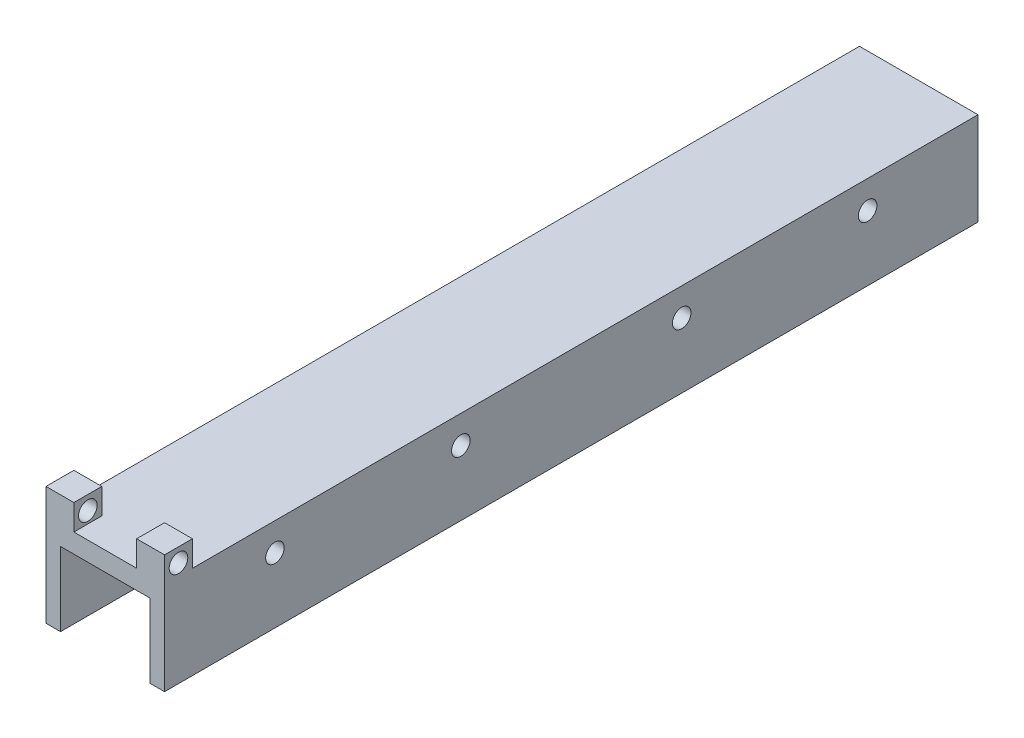
ISO-10303-21;
HEADER;
FILE_DESCRIPTION(('STEP AP214'),'2;1');
FILE_NAME('part.step','',(''),(''),'','','');
FILE_SCHEMA(('AUTOMOTIVE_DESIGN { 1 0 10303 214 1 1 1 1 }'));
ENDSEC;
DATA;
#1=APPLICATION_CONTEXT('core data for automotive mechanical design processes');
#2=APPLICATION_PROTOCOL_DEFINITION('international standard','automotive_design',2000,#1);
#3=PRODUCT_CONTEXT('',#1,'mechanical');
#4=PRODUCT('Part','Part','',(#3));
#5=PRODUCT_RELATED_PRODUCT_CATEGORY('part','',(#4));
#6=PRODUCT_DEFINITION_FORMATION('','',#4);
#7=PRODUCT_DEFINITION_CONTEXT('part definition',#1,'design');
#8=PRODUCT_DEFINITION('design','',#6,#7);
#9=PRODUCT_DEFINITION_SHAPE('','',#8);
#10=(LENGTH_UNIT() NAMED_UNIT(*) SI_UNIT(.MILLI.,.METRE.));
#11=(NAMED_UNIT(*) PLANE_ANGLE_UNIT() SI_UNIT($,.RADIAN.));
#12=(NAMED_UNIT(*) SI_UNIT($,.STERADIAN.) SOLID_ANGLE_UNIT());
#13=UNCERTAINTY_MEASURE_WITH_UNIT(LENGTH_MEASURE(1.E-05),#10,'distance_accuracy_value','');
#14=(GEOMETRIC_REPRESENTATION_CONTEXT(3) GLOBAL_UNCERTAINTY_ASSIGNED_CONTEXT((#13)) GLOBAL_UNIT_ASSIGNED_CONTEXT((#10,
#11,#12)) REPRESENTATION_CONTEXT('',''));
#15=CARTESIAN_POINT('',(0.,0.,0.));
#16=DIRECTION('',(0.,0.,1.));
#17=DIRECTION('',(1.,0.,0.));
#18=AXIS2_PLACEMENT_3D('',#15,#16,#17);
#19=CARTESIAN_POINT('',(3.175,16.129,-177.8));
#20=DIRECTION('',(0.,-1.,0.));
#21=DIRECTION('',(0.,0.,-1.));
#22=AXIS2_PLACEMENT_3D('',#19,#20,#21);
#23=PLANE('',#22);
#24=DIRECTION('',(0.,0.,1.));
#25=VECTOR('',#24,1.);
#26=CARTESIAN_POINT('',(3.175,16.129,-177.8));
#27=LINE('',#26,#25);
#28=CARTESIAN_POINT('',(3.175,16.129,-23.4228939259205));
#29=VERTEX_POINT('',#28);
#30=CARTESIAN_POINT('',(3.175,16.129,0.));
#31=VERTEX_POINT('',#30);
#32=EDGE_CURVE('E430',#29,#31,#27,.T.);
#33=ORIENTED_EDGE('',*,*,#32,.F.);
#34=DIRECTION('',(-1.,0.,0.));
#35=VECTOR('',#34,1.);
#36=CARTESIAN_POINT('',(25.908,16.129,-23.4228939259205));
#37=LINE('',#36,#35);
#38=CARTESIAN_POINT('',(22.733,16.129,-23.4228939259205));
#39=VERTEX_POINT('',#38);
#40=EDGE_CURVE('E335',#29,#39,#37,.F.);
#41=ORIENTED_EDGE('',*,*,#40,.T.);
#42=DIRECTION('',(0.,0.,1.));
#43=VECTOR('',#42,1.);
#44=CARTESIAN_POINT('',(22.733,16.129,-177.8));
#45=LINE('',#44,#43);
#46=CARTESIAN_POINT('',(22.733,16.129,0.));
#47=VERTEX_POINT('',#46);
#48=EDGE_CURVE('E424',#39,#47,#45,.T.);
#49=ORIENTED_EDGE('',*,*,#48,.T.);
#50=DIRECTION('',(1.,0.,0.));
#51=VECTOR('',#50,1.);
#52=CARTESIAN_POINT('',(3.175,16.129,0.));
#53=LINE('',#52,#51);
#54=EDGE_CURVE('E383',#31,#47,#53,.T.);
#55=ORIENTED_EDGE('',*,*,#54,.F.);
#56=EDGE_LOOP('',(#33,#41,#49,#55));
#57=FACE_BOUND('',#56,.T.);
#58=ADVANCED_FACE('F47',(#57),#23,.T.);
#59=CARTESIAN_POINT('',(22.733,16.129,-64.0628939259205));
#60=VERTEX_POINT('',#59);
#61=CARTESIAN_POINT('',(22.733,16.129,-24.8371060740794));
#62=VERTEX_POINT('',#61);
#63=EDGE_CURVE('E489',#60,#62,#45,.T.);
#64=ORIENTED_EDGE('',*,*,#63,.T.);
#65=DIRECTION('',(-1.,0.,0.));
#66=VECTOR('',#65,1.);
#67=CARTESIAN_POINT('',(25.908,16.129,-24.8371060740794));
#68=LINE('',#67,#66);
#69=CARTESIAN_POINT('',(3.175,16.129,-24.8371060740794));
#70=VERTEX_POINT('',#69);
#71=EDGE_CURVE('E331',#62,#70,#68,.T.);
#72=ORIENTED_EDGE('',*,*,#71,.T.);
#73=CARTESIAN_POINT('',(3.175,16.129,-64.0628939259205));
#74=VERTEX_POINT('',#73);
#75=EDGE_CURVE('E447',#74,#70,#27,.T.);
#76=ORIENTED_EDGE('',*,*,#75,.F.);
#77=DIRECTION('',(-1.,0.,0.));
#78=VECTOR('',#77,1.);
#79=CARTESIAN_POINT('',(25.908,16.129,-64.0628939259205));
#80=LINE('',#79,#78);
#81=EDGE_CURVE('E323',#74,#60,#80,.F.);
#82=ORIENTED_EDGE('',*,*,#81,.T.);
#83=EDGE_LOOP('',(#64,#72,#76,#82));
#84=FACE_BOUND('',#83,.T.);
#85=ADVANCED_FACE('F453',(#84),#23,.T.);
#86=CARTESIAN_POINT('',(22.733,16.129,-112.32289392592));
#87=VERTEX_POINT('',#86);
#88=CARTESIAN_POINT('',(22.733,16.129,-65.4771060740795));
#89=VERTEX_POINT('',#88);
#90=EDGE_CURVE('E491',#87,#89,#45,.T.);
#91=ORIENTED_EDGE('',*,*,#90,.T.);
#92=DIRECTION('',(-1.,0.,0.));
#93=VECTOR('',#92,1.);
#94=CARTESIAN_POINT('',(25.908,16.129,-65.4771060740795));
#95=LINE('',#94,#93);
#96=CARTESIAN_POINT('',(3.175,16.129,-65.4771060740795));
#97=VERTEX_POINT('',#96);
#98=EDGE_CURVE('E319',#89,#97,#95,.T.);
#99=ORIENTED_EDGE('',*,*,#98,.T.);
#100=CARTESIAN_POINT('',(3.175,16.129,-112.32289392592));
#101=VERTEX_POINT('',#100);
#102=EDGE_CURVE('E449',#101,#97,#27,.T.);
#103=ORIENTED_EDGE('',*,*,#102,.F.);
#104=DIRECTION('',(-1.,0.,0.));
#105=VECTOR('',#104,1.);
#106=CARTESIAN_POINT('',(25.908,16.129,-112.32289392592));
#107=LINE('',#106,#105);
#108=EDGE_CURVE('E311',#101,#87,#107,.F.);
#109=ORIENTED_EDGE('',*,*,#108,.T.);
#110=EDGE_LOOP('',(#91,#99,#103,#109));
#111=FACE_BOUND('',#110,.T.);
#112=ADVANCED_FACE('F501',(#111),#23,.T.);
#113=CARTESIAN_POINT('',(22.733,16.129,-152.96289392592));
#114=VERTEX_POINT('',#113);
#115=CARTESIAN_POINT('',(22.733,16.129,-113.737106074079));
#116=VERTEX_POINT('',#115);
#117=EDGE_CURVE('E423',#114,#116,#45,.T.);
#118=ORIENTED_EDGE('',*,*,#117,.T.);
#119=DIRECTION('',(-1.,0.,0.));
#120=VECTOR('',#119,1.);
#121=CARTESIAN_POINT('',(25.908,16.129,-113.737106074079));
#122=LINE('',#121,#120);
#123=CARTESIAN_POINT('',(3.175,16.129,-113.737106074079));
#124=VERTEX_POINT('',#123);
#125=EDGE_CURVE('E307',#116,#124,#122,.T.);
#126=ORIENTED_EDGE('',*,*,#125,.T.);
#127=CARTESIAN_POINT('',(3.175,16.129,-152.96289392592));
#128=VERTEX_POINT('',#127);
#129=EDGE_CURVE('E429',#128,#124,#27,.T.);
#130=ORIENTED_EDGE('',*,*,#129,.F.);
#131=DIRECTION('',(-1.,0.,0.));
#132=VECTOR('',#131,1.);
#133=CARTESIAN_POINT('',(25.908,16.129,-152.96289392592));
#134=LINE('',#133,#132);
#135=EDGE_CURVE('E299',#128,#114,#134,.F.);
#136=ORIENTED_EDGE('',*,*,#135,.T.);
#137=EDGE_LOOP('',(#118,#126,#130,#136));
#138=FACE_BOUND('',#137,.T.);
#139=ADVANCED_FACE('F484',(#138),#23,.T.);
#140=CARTESIAN_POINT('',(22.733,16.129,-177.8));
#141=VERTEX_POINT('',#140);
#142=CARTESIAN_POINT('',(22.733,16.129,-154.377106074079));
#143=VERTEX_POINT('',#142);
#144=EDGE_CURVE('E419',#141,#143,#45,.T.);
#145=ORIENTED_EDGE('',*,*,#144,.T.);
#146=DIRECTION('',(-1.,0.,0.));
#147=VECTOR('',#146,1.);
#148=CARTESIAN_POINT('',(25.908,16.129,-154.377106074079));
#149=LINE('',#148,#147);
#150=CARTESIAN_POINT('',(3.175,16.129,-154.377106074079));
#151=VERTEX_POINT('',#150);
#152=EDGE_CURVE('E272',#143,#151,#149,.T.);
#153=ORIENTED_EDGE('',*,*,#152,.T.);
#154=CARTESIAN_POINT('',(3.175,16.129,-177.8));
#155=VERTEX_POINT('',#154);
#156=EDGE_CURVE('E425',#155,#151,#27,.T.);
#157=ORIENTED_EDGE('',*,*,#156,.F.);
#158=DIRECTION('',(1.,0.,0.));
#159=VECTOR('',#158,1.);
#160=CARTESIAN_POINT('',(3.175,16.129,-177.8));
#161=LINE('',#160,#159);
#162=EDGE_CURVE('E353',#155,#141,#161,.T.);
#163=ORIENTED_EDGE('',*,*,#162,.T.);
#164=EDGE_LOOP('',(#145,#153,#157,#163));
#165=FACE_BOUND('',#164,.T.);
#166=ADVANCED_FACE('F478',(#165),#23,.T.);
#167=CARTESIAN_POINT('',(0.,0.,-177.8));
#168=DIRECTION('',(0.,-1.,0.));
#169=DIRECTION('',(0.,0.,-1.));
#170=AXIS2_PLACEMENT_3D('',#167,#168,#169);
#171=PLANE('',#170);
#172=DIRECTION('',(1.,0.,0.));
#173=VECTOR('',#172,1.);
#174=CARTESIAN_POINT('',(0.,0.,0.));
#175=LINE('',#174,#173);
#176=CARTESIAN_POINT('',(0.,0.,0.));
#177=VERTEX_POINT('',#176);
#178=CARTESIAN_POINT('',(3.175,0.,0.));
#179=VERTEX_POINT('',#178);
#180=EDGE_CURVE('E343',#177,#179,#175,.T.);
#181=ORIENTED_EDGE('',*,*,#180,.F.);
#182=DIRECTION('',(0.,0.,1.));
#183=VECTOR('',#182,1.);
#184=CARTESIAN_POINT('',(0.,0.,-177.8));
#185=LINE('',#184,#183);
#186=CARTESIAN_POINT('',(0.,0.,-177.8));
#187=VERTEX_POINT('',#186);
#188=EDGE_CURVE('E405',#187,#177,#185,.T.);
#189=ORIENTED_EDGE('',*,*,#188,.F.);
#190=DIRECTION('',(1.,0.,0.));
#191=VECTOR('',#190,1.);
#192=CARTESIAN_POINT('',(0.,0.,-177.8));
#193=LINE('',#192,#191);
#194=CARTESIAN_POINT('',(3.175,0.,-177.8));
#195=VERTEX_POINT('',#194);
#196=EDGE_CURVE('E344',#187,#195,#193,.T.);
#197=ORIENTED_EDGE('',*,*,#196,.T.);
#198=DIRECTION('',(0.,0.,1.));
#199=VECTOR('',#198,1.);
#200=CARTESIAN_POINT('',(3.175,0.,-177.8));
#201=LINE('',#200,#199);
#202=EDGE_CURVE('E375',#195,#179,#201,.T.);
#203=ORIENTED_EDGE('',*,*,#202,.T.);
#204=EDGE_LOOP('',(#181,#189,#197,#203));
#205=FACE_BOUND('',#204,.T.);
#206=ADVANCED_FACE('F49',(#205),#171,.T.);
#207=CARTESIAN_POINT('',(0.,0.,-177.8));
#208=DIRECTION('',(-1.,0.,0.));
#209=DIRECTION('',(0.,0.,1.));
#210=AXIS2_PLACEMENT_3D('',#207,#208,#209);
#211=PLANE('',#210);
#212=CARTESIAN_POINT('',(0.,22.86,-3.048));
#213=DIRECTION('',(-1.,0.,0.));
#214=DIRECTION('',(0.,0.,1.));
#215=AXIS2_PLACEMENT_3D('',#212,#213,#214);
#216=CIRCLE('',#215,2.032);
#217=CARTESIAN_POINT('',(0.,22.86,-1.016));
#218=VERTEX_POINT('',#217);
#219=EDGE_CURVE('E736',#218,#218,#216,.T.);
#220=ORIENTED_EDGE('',*,*,#219,.F.);
#221=EDGE_LOOP('',(#220));
#222=FACE_BOUND('',#221,.T.);
#223=CARTESIAN_POINT('',(0.,14.224,-24.13));
#224=DIRECTION('',(1.,0.,0.));
#225=DIRECTION('',(0.,0.,-1.));
#226=AXIS2_PLACEMENT_3D('',#223,#224,#225);
#227=CIRCLE('',#226,2.032);
#228=CARTESIAN_POINT('',(0.,14.224,-26.162));
#229=VERTEX_POINT('',#228);
#230=EDGE_CURVE('E273',#229,#229,#227,.T.);
#231=ORIENTED_EDGE('',*,*,#230,.T.);
#232=EDGE_LOOP('',(#231));
#233=FACE_BOUND('',#232,.T.);
#234=CARTESIAN_POINT('',(0.,14.224,-64.77));
#235=DIRECTION('',(1.,0.,0.));
#236=DIRECTION('',(0.,0.,-1.));
#237=AXIS2_PLACEMENT_3D('',#234,#235,#236);
#238=CIRCLE('',#237,2.03200000000001);
#239=CARTESIAN_POINT('',(0.,14.224,-66.802));
#240=VERTEX_POINT('',#239);
#241=EDGE_CURVE('E277',#240,#240,#238,.T.);
#242=ORIENTED_EDGE('',*,*,#241,.T.);
#243=EDGE_LOOP('',(#242));
#244=FACE_BOUND('',#243,.T.);
#245=CARTESIAN_POINT('',(0.,14.224,-113.03));
#246=DIRECTION('',(1.,0.,0.));
#247=DIRECTION('',(0.,0.,1.));
#248=AXIS2_PLACEMENT_3D('',#245,#246,#247);
#249=CIRCLE('',#248,2.03200000000001);
#250=CARTESIAN_POINT('',(0.,14.224,-110.998));
#251=VERTEX_POINT('',#250);
#252=EDGE_CURVE('E285',#251,#251,#249,.T.);
#253=ORIENTED_EDGE('',*,*,#252,.T.);
#254=EDGE_LOOP('',(#253));
#255=FACE_BOUND('',#254,.T.);
#256=CARTESIAN_POINT('',(0.,14.224,-153.67));
#257=DIRECTION('',(1.,0.,0.));
#258=DIRECTION('',(0.,0.,1.));
#259=AXIS2_PLACEMENT_3D('',#256,#257,#258);
#260=CIRCLE('',#259,2.03200000000001);
#261=CARTESIAN_POINT('',(0.,14.224,-151.638));
#262=VERTEX_POINT('',#261);
#263=EDGE_CURVE('E229',#262,#262,#260,.T.);
#264=ORIENTED_EDGE('',*,*,#263,.T.);
#265=EDGE_LOOP('',(#264));
#266=FACE_BOUND('',#265,.T.);
#267=DIRECTION('',(0.,-1.,0.));
#268=VECTOR('',#267,1.);
#269=CARTESIAN_POINT('',(0.,0.,0.));
#270=LINE('',#269,#268);
#271=CARTESIAN_POINT('',(0.,25.908,0.));
#272=VERTEX_POINT('',#271);
#273=EDGE_CURVE('E349',#272,#177,#270,.T.);
#274=ORIENTED_EDGE('',*,*,#273,.F.);
#275=DIRECTION('',(0.,0.,1.));
#276=VECTOR('',#275,1.);
#277=CARTESIAN_POINT('',(0.,25.908,0.));
#278=LINE('',#277,#276);
#279=CARTESIAN_POINT('',(0.,25.908,-6.096));
#280=VERTEX_POINT('',#279);
#281=EDGE_CURVE('E253',#280,#272,#278,.T.);
#282=ORIENTED_EDGE('',*,*,#281,.F.);
#283=DIRECTION('',(0.,-1.,0.));
#284=VECTOR('',#283,1.);
#285=CARTESIAN_POINT('',(0.,25.908,-6.096));
#286=LINE('',#285,#284);
#287=CARTESIAN_POINT('',(0.,20.32,-6.09599999999999));
#288=VERTEX_POINT('',#287);
#289=EDGE_CURVE('E244',#280,#288,#286,.T.);
#290=ORIENTED_EDGE('',*,*,#289,.T.);
#291=DIRECTION('',(0.,0.,1.));
#292=VECTOR('',#291,1.);
#293=CARTESIAN_POINT('',(0.,20.32,-177.8));
#294=LINE('',#293,#292);
#295=CARTESIAN_POINT('',(0.,20.32,-177.8));
#296=VERTEX_POINT('',#295);
#297=EDGE_CURVE('E64',#296,#288,#294,.T.);
#298=ORIENTED_EDGE('',*,*,#297,.F.);
#299=DIRECTION('',(0.,-1.,0.));
#300=VECTOR('',#299,1.);
#301=CARTESIAN_POINT('',(0.,0.,-177.8));
#302=LINE('',#301,#300);
#303=EDGE_CURVE('E371',#296,#187,#302,.T.);
#304=ORIENTED_EDGE('',*,*,#303,.T.);
#305=ORIENTED_EDGE('',*,*,#188,.T.);
#306=EDGE_LOOP('',(#274,#282,#290,#298,#304,#305));
#307=FACE_BOUND('',#306,.T.);
#308=ADVANCED_FACE('F514',(#222,#233,#244,#255,#266,#307),#211,.T.);
#309=CARTESIAN_POINT('',(0.,20.32,-177.8));
#310=DIRECTION('',(0.,1.,0.));
#311=DIRECTION('',(0.,0.,1.));
#312=AXIS2_PLACEMENT_3D('',#309,#310,#311);
#313=PLANE('',#312);
#314=DIRECTION('',(0.,0.,1.));
#315=VECTOR('',#314,1.);
#316=CARTESIAN_POINT('',(19.812,20.32,0.));
#317=LINE('',#316,#315);
#318=CARTESIAN_POINT('',(19.812,20.32,-6.096));
#319=VERTEX_POINT('',#318);
#320=CARTESIAN_POINT('',(19.812,20.32,0.));
#321=VERTEX_POINT('',#320);
#322=EDGE_CURVE('E218',#319,#321,#317,.T.);
#323=ORIENTED_EDGE('',*,*,#322,.F.);
#324=DIRECTION('',(-1.,0.,0.));
#325=VECTOR('',#324,1.);
#326=CARTESIAN_POINT('',(25.908,20.32,-6.096));
#327=LINE('',#326,#325);
#328=CARTESIAN_POINT('',(25.908,20.32,-6.09599999999999));
#329=VERTEX_POINT('',#328);
#330=EDGE_CURVE('E71',#329,#319,#327,.T.);
#331=ORIENTED_EDGE('',*,*,#330,.F.);
#332=DIRECTION('',(0.,0.,1.));
#333=VECTOR('',#332,1.);
#334=CARTESIAN_POINT('',(25.908,20.32,-177.8));
#335=LINE('',#334,#333);
#336=CARTESIAN_POINT('',(25.908,20.32,-177.8));
#337=VERTEX_POINT('',#336);
#338=EDGE_CURVE('E222',#337,#329,#335,.T.);
#339=ORIENTED_EDGE('',*,*,#338,.F.);
#340=DIRECTION('',(-1.,0.,0.));
#341=VECTOR('',#340,1.);
#342=CARTESIAN_POINT('',(0.,20.32,-177.8));
#343=LINE('',#342,#341);
#344=EDGE_CURVE('E368',#337,#296,#343,.T.);
#345=ORIENTED_EDGE('',*,*,#344,.T.);
#346=ORIENTED_EDGE('',*,*,#297,.T.);
#347=DIRECTION('',(-1.,0.,0.));
#348=VECTOR('',#347,1.);
#349=CARTESIAN_POINT('',(0.,20.32,-6.096));
#350=LINE('',#349,#348);
#351=CARTESIAN_POINT('',(6.096,20.32,-6.096));
#352=VERTEX_POINT('',#351);
#353=EDGE_CURVE('E249',#352,#288,#350,.T.);
#354=ORIENTED_EDGE('',*,*,#353,.F.);
#355=DIRECTION('',(0.,0.,-1.));
#356=VECTOR('',#355,1.);
#357=CARTESIAN_POINT('',(6.096,20.32,0.));
#358=LINE('',#357,#356);
#359=CARTESIAN_POINT('',(6.096,20.32,0.));
#360=VERTEX_POINT('',#359);
#361=EDGE_CURVE('E252',#360,#352,#358,.T.);
#362=ORIENTED_EDGE('',*,*,#361,.F.);
#363=DIRECTION('',(-1.,0.,0.));
#364=VECTOR('',#363,1.);
#365=CARTESIAN_POINT('',(0.,20.32,0.));
#366=LINE('',#365,#364);
#367=EDGE_CURVE('E398',#321,#360,#366,.T.);
#368=ORIENTED_EDGE('',*,*,#367,.F.);
#369=EDGE_LOOP('',(#323,#331,#339,#345,#346,#354,#362,#368));
#370=FACE_BOUND('',#369,.T.);
#371=ADVANCED_FACE('F517',(#370),#313,.T.);
#372=CARTESIAN_POINT('',(25.908,0.,-177.8));
#373=DIRECTION('',(1.,0.,0.));
#374=DIRECTION('',(0.,0.,-1.));
#375=AXIS2_PLACEMENT_3D('',#372,#373,#374);
#376=PLANE('',#375);
#377=CARTESIAN_POINT('',(25.908,22.86,-3.048));
#378=DIRECTION('',(-1.,0.,0.));
#379=DIRECTION('',(0.,0.,1.));
#380=AXIS2_PLACEMENT_3D('',#377,#378,#379);
#381=CIRCLE('',#380,2.032);
#382=CARTESIAN_POINT('',(25.908,22.86,-1.016));
#383=VERTEX_POINT('',#382);
#384=EDGE_CURVE('E742',#383,#383,#381,.T.);
#385=ORIENTED_EDGE('',*,*,#384,.T.);
#386=EDGE_LOOP('',(#385));
#387=FACE_BOUND('',#386,.T.);
#388=CARTESIAN_POINT('',(25.908,14.224,-24.13));
#389=DIRECTION('',(1.,0.,0.));
#390=DIRECTION('',(0.,0.,-1.));
#391=AXIS2_PLACEMENT_3D('',#388,#389,#390);
#392=CIRCLE('',#391,2.032);
#393=CARTESIAN_POINT('',(25.908,14.224,-26.162));
#394=VERTEX_POINT('',#393);
#395=EDGE_CURVE('E268',#394,#394,#392,.T.);
#396=ORIENTED_EDGE('',*,*,#395,.F.);
#397=EDGE_LOOP('',(#396));
#398=FACE_BOUND('',#397,.T.);
#399=CARTESIAN_POINT('',(25.908,14.224,-64.77));
#400=DIRECTION('',(1.,0.,0.));
#401=DIRECTION('',(0.,0.,-1.));
#402=AXIS2_PLACEMENT_3D('',#399,#400,#401);
#403=CIRCLE('',#402,2.03200000000001);
#404=CARTESIAN_POINT('',(25.908,14.224,-66.802));
#405=VERTEX_POINT('',#404);
#406=EDGE_CURVE('E281',#405,#405,#403,.T.);
#407=ORIENTED_EDGE('',*,*,#406,.F.);
#408=EDGE_LOOP('',(#407));
#409=FACE_BOUND('',#408,.T.);
#410=CARTESIAN_POINT('',(25.908,14.224,-113.03));
#411=DIRECTION('',(1.,0.,0.));
#412=DIRECTION('',(0.,0.,1.));
#413=AXIS2_PLACEMENT_3D('',#410,#411,#412);
#414=CIRCLE('',#413,2.03200000000001);
#415=CARTESIAN_POINT('',(25.908,14.224,-110.998));
#416=VERTEX_POINT('',#415);
#417=EDGE_CURVE('E289',#416,#416,#414,.T.);
#418=ORIENTED_EDGE('',*,*,#417,.F.);
#419=EDGE_LOOP('',(#418));
#420=FACE_BOUND('',#419,.T.);
#421=CARTESIAN_POINT('',(25.908,14.224,-153.67));
#422=DIRECTION('',(1.,0.,0.));
#423=DIRECTION('',(0.,0.,1.));
#424=AXIS2_PLACEMENT_3D('',#421,#422,#423);
#425=CIRCLE('',#424,2.03200000000001);
#426=CARTESIAN_POINT('',(25.908,14.224,-151.638));
#427=VERTEX_POINT('',#426);
#428=EDGE_CURVE('E224',#427,#427,#425,.T.);
#429=ORIENTED_EDGE('',*,*,#428,.F.);
#430=EDGE_LOOP('',(#429));
#431=FACE_BOUND('',#430,.T.);
#432=DIRECTION('',(0.,1.,0.));
#433=VECTOR('',#432,1.);
#434=CARTESIAN_POINT('',(25.908,0.,0.));
#435=LINE('',#434,#433);
#436=CARTESIAN_POINT('',(25.908,0.,0.));
#437=VERTEX_POINT('',#436);
#438=CARTESIAN_POINT('',(25.908,25.908,0.));
#439=VERTEX_POINT('',#438);
#440=EDGE_CURVE('E395',#437,#439,#435,.T.);
#441=ORIENTED_EDGE('',*,*,#440,.F.);
#442=DIRECTION('',(0.,0.,1.));
#443=VECTOR('',#442,1.);
#444=CARTESIAN_POINT('',(25.908,0.,-177.8));
#445=LINE('',#444,#443);
#446=CARTESIAN_POINT('',(25.908,0.,-177.8));
#447=VERTEX_POINT('',#446);
#448=EDGE_CURVE('E413',#447,#437,#445,.T.);
#449=ORIENTED_EDGE('',*,*,#448,.F.);
#450=DIRECTION('',(0.,1.,0.));
#451=VECTOR('',#450,1.);
#452=CARTESIAN_POINT('',(25.908,0.,-177.8));
#453=LINE('',#452,#451);
#454=EDGE_CURVE('E365',#447,#337,#453,.T.);
#455=ORIENTED_EDGE('',*,*,#454,.T.);
#456=ORIENTED_EDGE('',*,*,#338,.T.);
#457=DIRECTION('',(0.,-1.,0.));
#458=VECTOR('',#457,1.);
#459=CARTESIAN_POINT('',(25.908,25.908,-6.096));
#460=LINE('',#459,#458);
#461=CARTESIAN_POINT('',(25.908,25.908,-6.096));
#462=VERTEX_POINT('',#461);
#463=EDGE_CURVE('E201',#462,#329,#460,.T.);
#464=ORIENTED_EDGE('',*,*,#463,.F.);
#465=DIRECTION('',(0.,0.,-1.));
#466=VECTOR('',#465,1.);
#467=CARTESIAN_POINT('',(25.908,25.908,0.));
#468=LINE('',#467,#466);
#469=EDGE_CURVE('E208',#439,#462,#468,.T.);
#470=ORIENTED_EDGE('',*,*,#469,.F.);
#471=EDGE_LOOP('',(#441,#449,#455,#456,#464,#470));
#472=FACE_BOUND('',#471,.T.);
#473=ADVANCED_FACE('F220',(#387,#398,#409,#420,#431,#472),#376,.T.);
#474=CARTESIAN_POINT('',(22.733,0.,-177.8));
#475=DIRECTION('',(0.,-1.,0.));
#476=DIRECTION('',(0.,0.,-1.));
#477=AXIS2_PLACEMENT_3D('',#474,#475,#476);
#478=PLANE('',#477);
#479=DIRECTION('',(1.,0.,0.));
#480=VECTOR('',#479,1.);
#481=CARTESIAN_POINT('',(22.733,0.,0.));
#482=LINE('',#481,#480);
#483=CARTESIAN_POINT('',(22.733,0.,0.));
#484=VERTEX_POINT('',#483);
#485=EDGE_CURVE('E391',#484,#437,#482,.T.);
#486=ORIENTED_EDGE('',*,*,#485,.F.);
#487=DIRECTION('',(0.,0.,1.));
#488=VECTOR('',#487,1.);
#489=CARTESIAN_POINT('',(22.733,0.,-177.8));
#490=LINE('',#489,#488);
#491=CARTESIAN_POINT('',(22.733,0.,-177.8));
#492=VERTEX_POINT('',#491);
#493=EDGE_CURVE('E416',#492,#484,#490,.T.);
#494=ORIENTED_EDGE('',*,*,#493,.F.);
#495=DIRECTION('',(1.,0.,0.));
#496=VECTOR('',#495,1.);
#497=CARTESIAN_POINT('',(22.733,0.,-177.8));
#498=LINE('',#497,#496);
#499=EDGE_CURVE('E361',#492,#447,#498,.T.);
#500=ORIENTED_EDGE('',*,*,#499,.T.);
#501=ORIENTED_EDGE('',*,*,#448,.T.);
#502=EDGE_LOOP('',(#486,#494,#500,#501));
#503=FACE_BOUND('',#502,.T.);
#504=ADVANCED_FACE('F540',(#503),#478,.T.);
#505=CARTESIAN_POINT('',(22.733,16.129,-177.8));
#506=DIRECTION('',(-1.,0.,0.));
#507=DIRECTION('',(0.,0.,1.));
#508=AXIS2_PLACEMENT_3D('',#505,#506,#507);
#509=PLANE('',#508);
#510=ORIENTED_EDGE('',*,*,#48,.F.);
#511=CARTESIAN_POINT('',(22.733,14.224,-24.13));
#512=DIRECTION('',(-1.,0.,0.));
#513=DIRECTION('',(0.,0.,1.));
#514=AXIS2_PLACEMENT_3D('',#511,#512,#513);
#515=CIRCLE('',#514,2.032);
#516=EDGE_CURVE('E339',#39,#62,#515,.F.);
#517=ORIENTED_EDGE('',*,*,#516,.T.);
#518=ORIENTED_EDGE('',*,*,#63,.F.);
#519=CARTESIAN_POINT('',(22.733,14.224,-64.77));
#520=DIRECTION('',(-1.,0.,0.));
#521=DIRECTION('',(0.,0.,1.));
#522=AXIS2_PLACEMENT_3D('',#519,#520,#521);
#523=CIRCLE('',#522,2.03200000000001);
#524=EDGE_CURVE('E327',#60,#89,#523,.F.);
#525=ORIENTED_EDGE('',*,*,#524,.T.);
#526=ORIENTED_EDGE('',*,*,#90,.F.);
#527=CARTESIAN_POINT('',(22.733,14.224,-113.03));
#528=DIRECTION('',(-1.,0.,0.));
#529=DIRECTION('',(0.,0.,1.));
#530=AXIS2_PLACEMENT_3D('',#527,#528,#529);
#531=CIRCLE('',#530,2.03200000000001);
#532=EDGE_CURVE('E315',#87,#116,#531,.F.);
#533=ORIENTED_EDGE('',*,*,#532,.T.);
#534=ORIENTED_EDGE('',*,*,#117,.F.);
#535=CARTESIAN_POINT('',(22.733,14.224,-153.67));
#536=DIRECTION('',(-1.,0.,0.));
#537=DIRECTION('',(0.,0.,1.));
#538=AXIS2_PLACEMENT_3D('',#535,#536,#537);
#539=CIRCLE('',#538,2.03200000000001);
#540=EDGE_CURVE('E303',#114,#143,#539,.F.);
#541=ORIENTED_EDGE('',*,*,#540,.T.);
#542=ORIENTED_EDGE('',*,*,#144,.F.);
#543=DIRECTION('',(0.,-1.,0.));
#544=VECTOR('',#543,1.);
#545=CARTESIAN_POINT('',(22.733,16.129,-177.8));
#546=LINE('',#545,#544);
#547=EDGE_CURVE('E357',#141,#492,#546,.T.);
#548=ORIENTED_EDGE('',*,*,#547,.T.);
#549=ORIENTED_EDGE('',*,*,#493,.T.);
#550=DIRECTION('',(0.,-1.,0.));
#551=VECTOR('',#550,1.);
#552=CARTESIAN_POINT('',(22.733,16.129,0.));
#553=LINE('',#552,#551);
#554=EDGE_CURVE('E387',#47,#484,#553,.T.);
#555=ORIENTED_EDGE('',*,*,#554,.F.);
#556=EDGE_LOOP('',(#510,#517,#518,#525,#526,#533,#534,#541,#542,#548,#549,#555));
#557=FACE_BOUND('',#556,.T.);
#558=ADVANCED_FACE('F495',(#557),#509,.T.);
#559=CARTESIAN_POINT('',(3.175,0.,-177.8));
#560=DIRECTION('',(1.,0.,0.));
#561=DIRECTION('',(0.,0.,-1.));
#562=AXIS2_PLACEMENT_3D('',#559,#560,#561);
#563=PLANE('',#562);
#564=ORIENTED_EDGE('',*,*,#75,.T.);
#565=CARTESIAN_POINT('',(3.175,14.224,-24.13));
#566=DIRECTION('',(1.,0.,0.));
#567=DIRECTION('',(0.,0.,-1.));
#568=AXIS2_PLACEMENT_3D('',#565,#566,#567);
#569=CIRCLE('',#568,2.032);
#570=EDGE_CURVE('E11',#70,#29,#569,.F.);
#571=ORIENTED_EDGE('',*,*,#570,.T.);
#572=ORIENTED_EDGE('',*,*,#32,.T.);
#573=DIRECTION('',(0.,1.,0.));
#574=VECTOR('',#573,1.);
#575=CARTESIAN_POINT('',(3.175,0.,0.));
#576=LINE('',#575,#574);
#577=EDGE_CURVE('E379',#179,#31,#576,.T.);
#578=ORIENTED_EDGE('',*,*,#577,.F.);
#579=ORIENTED_EDGE('',*,*,#202,.F.);
#580=DIRECTION('',(0.,1.,0.));
#581=VECTOR('',#580,1.);
#582=CARTESIAN_POINT('',(3.175,0.,-177.8));
#583=LINE('',#582,#581);
#584=EDGE_CURVE('E348',#195,#155,#583,.T.);
#585=ORIENTED_EDGE('',*,*,#584,.T.);
#586=ORIENTED_EDGE('',*,*,#156,.T.);
#587=CARTESIAN_POINT('',(3.175,14.224,-153.67));
#588=DIRECTION('',(1.,0.,0.));
#589=DIRECTION('',(0.,0.,-1.));
#590=AXIS2_PLACEMENT_3D('',#587,#588,#589);
#591=CIRCLE('',#590,2.03200000000001);
#592=EDGE_CURVE('E408',#151,#128,#591,.F.);
#593=ORIENTED_EDGE('',*,*,#592,.T.);
#594=ORIENTED_EDGE('',*,*,#129,.T.);
#595=CARTESIAN_POINT('',(3.175,14.224,-113.03));
#596=DIRECTION('',(1.,0.,0.));
#597=DIRECTION('',(0.,0.,-1.));
#598=AXIS2_PLACEMENT_3D('',#595,#596,#597);
#599=CIRCLE('',#598,2.03200000000001);
#600=EDGE_CURVE('E436',#124,#101,#599,.F.);
#601=ORIENTED_EDGE('',*,*,#600,.T.);
#602=ORIENTED_EDGE('',*,*,#102,.T.);
#603=CARTESIAN_POINT('',(3.175,14.224,-64.77));
#604=DIRECTION('',(1.,0.,0.));
#605=DIRECTION('',(0.,0.,-1.));
#606=AXIS2_PLACEMENT_3D('',#603,#604,#605);
#607=CIRCLE('',#606,2.03200000000001);
#608=EDGE_CURVE('E57',#97,#74,#607,.F.);
#609=ORIENTED_EDGE('',*,*,#608,.T.);
#610=EDGE_LOOP('',(#564,#571,#572,#578,#579,#585,#586,#593,#594,#601,#602,#609));
#611=FACE_BOUND('',#610,.T.);
#612=ADVANCED_FACE('F446',(#611),#563,.T.);
#613=CARTESIAN_POINT('',(0.,0.,-177.8));
#614=DIRECTION('',(0.,0.,1.));
#615=DIRECTION('',(1.,0.,0.));
#616=AXIS2_PLACEMENT_3D('',#613,#614,#615);
#617=PLANE('',#616);
#618=ORIENTED_EDGE('',*,*,#196,.F.);
#619=ORIENTED_EDGE('',*,*,#303,.F.);
#620=ORIENTED_EDGE('',*,*,#344,.F.);
#621=ORIENTED_EDGE('',*,*,#454,.F.);
#622=ORIENTED_EDGE('',*,*,#499,.F.);
#623=ORIENTED_EDGE('',*,*,#547,.F.);
#624=ORIENTED_EDGE('',*,*,#162,.F.);
#625=ORIENTED_EDGE('',*,*,#584,.F.);
#626=EDGE_LOOP('',(#618,#619,#620,#621,#622,#623,#624,#625));
#627=FACE_BOUND('',#626,.T.);
#628=ADVANCED_FACE('F473',(#627),#617,.F.);
#629=CARTESIAN_POINT('',(0.,0.,0.));
#630=DIRECTION('',(0.,0.,1.));
#631=DIRECTION('',(1.,0.,0.));
#632=AXIS2_PLACEMENT_3D('',#629,#630,#631);
#633=PLANE('',#632);
#634=ORIENTED_EDGE('',*,*,#180,.T.);
#635=ORIENTED_EDGE('',*,*,#577,.T.);
#636=ORIENTED_EDGE('',*,*,#54,.T.);
#637=ORIENTED_EDGE('',*,*,#554,.T.);
#638=ORIENTED_EDGE('',*,*,#485,.T.);
#639=ORIENTED_EDGE('',*,*,#440,.T.);
#640=DIRECTION('',(1.,0.,0.));
#641=VECTOR('',#640,1.);
#642=CARTESIAN_POINT('',(25.908,25.908,0.));
#643=LINE('',#642,#641);
#644=CARTESIAN_POINT('',(19.812,25.908,0.));
#645=VERTEX_POINT('',#644);
#646=EDGE_CURVE('E214',#645,#439,#643,.T.);
#647=ORIENTED_EDGE('',*,*,#646,.F.);
#648=DIRECTION('',(0.,-1.,0.));
#649=VECTOR('',#648,1.);
#650=CARTESIAN_POINT('',(19.812,25.908,0.));
#651=LINE('',#650,#649);
#652=EDGE_CURVE('E231',#645,#321,#651,.T.);
#653=ORIENTED_EDGE('',*,*,#652,.T.);
#654=ORIENTED_EDGE('',*,*,#367,.T.);
#655=DIRECTION('',(0.,-1.,0.));
#656=VECTOR('',#655,1.);
#657=CARTESIAN_POINT('',(6.096,25.908,0.));
#658=LINE('',#657,#656);
#659=CARTESIAN_POINT('',(6.096,25.908,0.));
#660=VERTEX_POINT('',#659);
#661=EDGE_CURVE('E235',#660,#360,#658,.T.);
#662=ORIENTED_EDGE('',*,*,#661,.F.);
#663=DIRECTION('',(1.,0.,0.));
#664=VECTOR('',#663,1.);
#665=CARTESIAN_POINT('',(0.,25.908,0.));
#666=LINE('',#665,#664);
#667=EDGE_CURVE('E262',#272,#660,#666,.T.);
#668=ORIENTED_EDGE('',*,*,#667,.F.);
#669=ORIENTED_EDGE('',*,*,#273,.T.);
#670=EDGE_LOOP('',(#634,#635,#636,#637,#638,#639,#647,#653,#654,#662,#668,#669));
#671=FACE_BOUND('',#670,.T.);
#672=ADVANCED_FACE('F465',(#671),#633,.T.);
#673=CARTESIAN_POINT('',(25.908,14.224,-153.67));
#674=DIRECTION('',(-1.,0.,0.));
#675=DIRECTION('',(0.,0.,1.));
#676=AXIS2_PLACEMENT_3D('',#673,#674,#675);
#677=CYLINDRICAL_SURFACE('',#676,2.03200000000001);
#678=ORIENTED_EDGE('',*,*,#135,.F.);
#679=ORIENTED_EDGE('',*,*,#592,.F.);
#680=ORIENTED_EDGE('',*,*,#152,.F.);
#681=ORIENTED_EDGE('',*,*,#540,.F.);
#682=EDGE_LOOP('',(#678,#679,#680,#681));
#683=FACE_BOUND('',#682,.T.);
#684=ORIENTED_EDGE('',*,*,#428,.T.);
#685=EDGE_LOOP('',(#684));
#686=FACE_BOUND('',#685,.T.);
#687=ORIENTED_EDGE('',*,*,#263,.F.);
#688=EDGE_LOOP('',(#687));
#689=FACE_BOUND('',#688,.T.);
#690=ADVANCED_FACE('F602',(#683,#686,#689),#677,.F.);
#691=CARTESIAN_POINT('',(25.908,14.224,-113.03));
#692=DIRECTION('',(-1.,0.,0.));
#693=DIRECTION('',(0.,0.,1.));
#694=AXIS2_PLACEMENT_3D('',#691,#692,#693);
#695=CYLINDRICAL_SURFACE('',#694,2.03200000000001);
#696=ORIENTED_EDGE('',*,*,#108,.F.);
#697=ORIENTED_EDGE('',*,*,#600,.F.);
#698=ORIENTED_EDGE('',*,*,#125,.F.);
#699=ORIENTED_EDGE('',*,*,#532,.F.);
#700=EDGE_LOOP('',(#696,#697,#698,#699));
#701=FACE_BOUND('',#700,.T.);
#702=ORIENTED_EDGE('',*,*,#417,.T.);
#703=EDGE_LOOP('',(#702));
#704=FACE_BOUND('',#703,.T.);
#705=ORIENTED_EDGE('',*,*,#252,.F.);
#706=EDGE_LOOP('',(#705));
#707=FACE_BOUND('',#706,.T.);
#708=ADVANCED_FACE('F498',(#701,#704,#707),#695,.F.);
#709=CARTESIAN_POINT('',(25.908,14.224,-64.77));
#710=DIRECTION('',(-1.,0.,0.));
#711=DIRECTION('',(0.,0.,1.));
#712=AXIS2_PLACEMENT_3D('',#709,#710,#711);
#713=CYLINDRICAL_SURFACE('',#712,2.03200000000001);
#714=ORIENTED_EDGE('',*,*,#81,.F.);
#715=ORIENTED_EDGE('',*,*,#608,.F.);
#716=ORIENTED_EDGE('',*,*,#98,.F.);
#717=ORIENTED_EDGE('',*,*,#524,.F.);
#718=EDGE_LOOP('',(#714,#715,#716,#717));
#719=FACE_BOUND('',#718,.T.);
#720=ORIENTED_EDGE('',*,*,#406,.T.);
#721=EDGE_LOOP('',(#720));
#722=FACE_BOUND('',#721,.T.);
#723=ORIENTED_EDGE('',*,*,#241,.F.);
#724=EDGE_LOOP('',(#723));
#725=FACE_BOUND('',#724,.T.);
#726=ADVANCED_FACE('F502',(#719,#722,#725),#713,.F.);
#727=CARTESIAN_POINT('',(25.908,14.224,-24.13));
#728=DIRECTION('',(-1.,0.,0.));
#729=DIRECTION('',(0.,0.,1.));
#730=AXIS2_PLACEMENT_3D('',#727,#728,#729);
#731=CYLINDRICAL_SURFACE('',#730,2.032);
#732=ORIENTED_EDGE('',*,*,#40,.F.);
#733=ORIENTED_EDGE('',*,*,#570,.F.);
#734=ORIENTED_EDGE('',*,*,#71,.F.);
#735=ORIENTED_EDGE('',*,*,#516,.F.);
#736=EDGE_LOOP('',(#732,#733,#734,#735));
#737=FACE_BOUND('',#736,.T.);
#738=ORIENTED_EDGE('',*,*,#395,.T.);
#739=EDGE_LOOP('',(#738));
#740=FACE_BOUND('',#739,.T.);
#741=ORIENTED_EDGE('',*,*,#230,.F.);
#742=EDGE_LOOP('',(#741));
#743=FACE_BOUND('',#742,.T.);
#744=ADVANCED_FACE('F505',(#737,#740,#743),#731,.F.);
#745=CARTESIAN_POINT('',(6.096,25.908,0.));
#746=DIRECTION('',(-1.,0.,0.));
#747=DIRECTION('',(0.,0.,1.));
#748=AXIS2_PLACEMENT_3D('',#745,#746,#747);
#749=PLANE('',#748);
#750=CARTESIAN_POINT('',(6.096,22.86,-3.048));
#751=DIRECTION('',(-1.,0.,0.));
#752=DIRECTION('',(0.,0.,1.));
#753=AXIS2_PLACEMENT_3D('',#750,#751,#752);
#754=CIRCLE('',#753,2.032);
#755=CARTESIAN_POINT('',(6.096,22.86,-1.016));
#756=VERTEX_POINT('',#755);
#757=EDGE_CURVE('E240',#756,#756,#754,.T.);
#758=ORIENTED_EDGE('',*,*,#757,.T.);
#759=EDGE_LOOP('',(#758));
#760=FACE_BOUND('',#759,.T.);
#761=ORIENTED_EDGE('',*,*,#361,.T.);
#762=DIRECTION('',(0.,-1.,0.));
#763=VECTOR('',#762,1.);
#764=CARTESIAN_POINT('',(6.096,25.908,-6.096));
#765=LINE('',#764,#763);
#766=CARTESIAN_POINT('',(6.096,25.908,-6.096));
#767=VERTEX_POINT('',#766);
#768=EDGE_CURVE('E239',#767,#352,#765,.T.);
#769=ORIENTED_EDGE('',*,*,#768,.F.);
#770=DIRECTION('',(0.,0.,-1.));
#771=VECTOR('',#770,1.);
#772=CARTESIAN_POINT('',(6.096,25.908,0.));
#773=LINE('',#772,#771);
#774=EDGE_CURVE('E259',#660,#767,#773,.T.);
#775=ORIENTED_EDGE('',*,*,#774,.F.);
#776=ORIENTED_EDGE('',*,*,#661,.T.);
#777=EDGE_LOOP('',(#761,#769,#775,#776));
#778=FACE_BOUND('',#777,.T.);
#779=ADVANCED_FACE('F508',(#760,#778),#749,.F.);
#780=CARTESIAN_POINT('',(0.,25.908,-6.096));
#781=DIRECTION('',(0.,0.,1.));
#782=DIRECTION('',(1.,0.,0.));
#783=AXIS2_PLACEMENT_3D('',#780,#781,#782);
#784=PLANE('',#783);
#785=ORIENTED_EDGE('',*,*,#353,.T.);
#786=ORIENTED_EDGE('',*,*,#289,.F.);
#787=DIRECTION('',(-1.,0.,0.));
#788=VECTOR('',#787,1.);
#789=CARTESIAN_POINT('',(0.,25.908,-6.096));
#790=LINE('',#789,#788);
#791=EDGE_CURVE('E248',#767,#280,#790,.T.);
#792=ORIENTED_EDGE('',*,*,#791,.F.);
#793=ORIENTED_EDGE('',*,*,#768,.T.);
#794=EDGE_LOOP('',(#785,#786,#792,#793));
#795=FACE_BOUND('',#794,.T.);
#796=ADVANCED_FACE('F535',(#795),#784,.F.);
#797=CARTESIAN_POINT('',(0.,25.908,0.));
#798=DIRECTION('',(0.,-1.,0.));
#799=DIRECTION('',(0.,0.,-1.));
#800=AXIS2_PLACEMENT_3D('',#797,#798,#799);
#801=PLANE('',#800);
#802=ORIENTED_EDGE('',*,*,#281,.T.);
#803=ORIENTED_EDGE('',*,*,#667,.T.);
#804=ORIENTED_EDGE('',*,*,#774,.T.);
#805=ORIENTED_EDGE('',*,*,#791,.T.);
#806=EDGE_LOOP('',(#802,#803,#804,#805));
#807=FACE_BOUND('',#806,.T.);
#808=ADVANCED_FACE('F530',(#807),#801,.F.);
#809=CARTESIAN_POINT('',(25.908,25.908,-6.096));
#810=DIRECTION('',(0.,0.,1.));
#811=DIRECTION('',(1.,0.,0.));
#812=AXIS2_PLACEMENT_3D('',#809,#810,#811);
#813=PLANE('',#812);
#814=ORIENTED_EDGE('',*,*,#330,.T.);
#815=DIRECTION('',(0.,-1.,0.));
#816=VECTOR('',#815,1.);
#817=CARTESIAN_POINT('',(19.812,25.908,-6.096));
#818=LINE('',#817,#816);
#819=CARTESIAN_POINT('',(19.812,25.908,-6.096));
#820=VERTEX_POINT('',#819);
#821=EDGE_CURVE('E203',#820,#319,#818,.T.);
#822=ORIENTED_EDGE('',*,*,#821,.F.);
#823=DIRECTION('',(-1.,0.,0.));
#824=VECTOR('',#823,1.);
#825=CARTESIAN_POINT('',(25.908,25.908,-6.096));
#826=LINE('',#825,#824);
#827=EDGE_CURVE('E197',#462,#820,#826,.T.);
#828=ORIENTED_EDGE('',*,*,#827,.F.);
#829=ORIENTED_EDGE('',*,*,#463,.T.);
#830=EDGE_LOOP('',(#814,#822,#828,#829));
#831=FACE_BOUND('',#830,.T.);
#832=ADVANCED_FACE('F199',(#831),#813,.F.);
#833=CARTESIAN_POINT('',(19.812,25.908,0.));
#834=DIRECTION('',(1.,0.,0.));
#835=DIRECTION('',(0.,0.,-1.));
#836=AXIS2_PLACEMENT_3D('',#833,#834,#835);
#837=PLANE('',#836);
#838=CARTESIAN_POINT('',(19.812,22.86,-3.048));
#839=DIRECTION('',(1.,0.,0.));
#840=DIRECTION('',(0.,0.,-1.));
#841=AXIS2_PLACEMENT_3D('',#838,#839,#840);
#842=CIRCLE('',#841,2.032);
#843=CARTESIAN_POINT('',(19.812,22.86,-5.08));
#844=VERTEX_POINT('',#843);
#845=EDGE_CURVE('E51',#844,#844,#842,.T.);
#846=ORIENTED_EDGE('',*,*,#845,.T.);
#847=EDGE_LOOP('',(#846));
#848=FACE_BOUND('',#847,.T.);
#849=ORIENTED_EDGE('',*,*,#322,.T.);
#850=ORIENTED_EDGE('',*,*,#652,.F.);
#851=DIRECTION('',(0.,0.,1.));
#852=VECTOR('',#851,1.);
#853=CARTESIAN_POINT('',(19.812,25.908,0.));
#854=LINE('',#853,#852);
#855=EDGE_CURVE('E207',#820,#645,#854,.T.);
#856=ORIENTED_EDGE('',*,*,#855,.F.);
#857=ORIENTED_EDGE('',*,*,#821,.T.);
#858=EDGE_LOOP('',(#849,#850,#856,#857));
#859=FACE_BOUND('',#858,.T.);
#860=ADVANCED_FACE('F554',(#848,#859),#837,.F.);
#861=CARTESIAN_POINT('',(0.,25.908,0.));
#862=DIRECTION('',(0.,1.,0.));
#863=DIRECTION('',(0.,0.,1.));
#864=AXIS2_PLACEMENT_3D('',#861,#862,#863);
#865=PLANE('',#864);
#866=ORIENTED_EDGE('',*,*,#469,.T.);
#867=ORIENTED_EDGE('',*,*,#827,.T.);
#868=ORIENTED_EDGE('',*,*,#855,.T.);
#869=ORIENTED_EDGE('',*,*,#646,.T.);
#870=EDGE_LOOP('',(#866,#867,#868,#869));
#871=FACE_BOUND('',#870,.T.);
#872=ADVANCED_FACE('F212',(#871),#865,.T.);
#873=CARTESIAN_POINT('',(25.908,22.86,-3.048));
#874=DIRECTION('',(-1.,0.,0.));
#875=DIRECTION('',(0.,0.,1.));
#876=AXIS2_PLACEMENT_3D('',#873,#874,#875);
#877=CYLINDRICAL_SURFACE('',#876,2.032);
#878=ORIENTED_EDGE('',*,*,#384,.F.);
#879=EDGE_LOOP('',(#878));
#880=FACE_BOUND('',#879,.T.);
#881=ORIENTED_EDGE('',*,*,#845,.F.);
#882=EDGE_LOOP('',(#881));
#883=FACE_BOUND('',#882,.T.);
#884=ADVANCED_FACE('F713',(#880,#883),#877,.F.);
#885=ORIENTED_EDGE('',*,*,#219,.T.);
#886=EDGE_LOOP('',(#885));
#887=FACE_BOUND('',#886,.T.);
#888=ORIENTED_EDGE('',*,*,#757,.F.);
#889=EDGE_LOOP('',(#888));
#890=FACE_BOUND('',#889,.T.);
#891=ADVANCED_FACE('F721',(#887,#890),#877,.F.);
#892=CLOSED_SHELL('',(#58,#85,#112,#139,#166,#206,#308,#371,#473,#504,#558,#612,#628,#672,#690,
#708,#726,#744,#779,#796,#808,#832,#860,#872,#884,#891));
#893=MANIFOLD_SOLID_BREP('B2',#892);
#894=ADVANCED_BREP_SHAPE_REPRESENTATION('',(#18,#893),#14);
#895=SHAPE_DEFINITION_REPRESENTATION(#9,#894);
ENDSEC;
END-ISO-10303-21;
